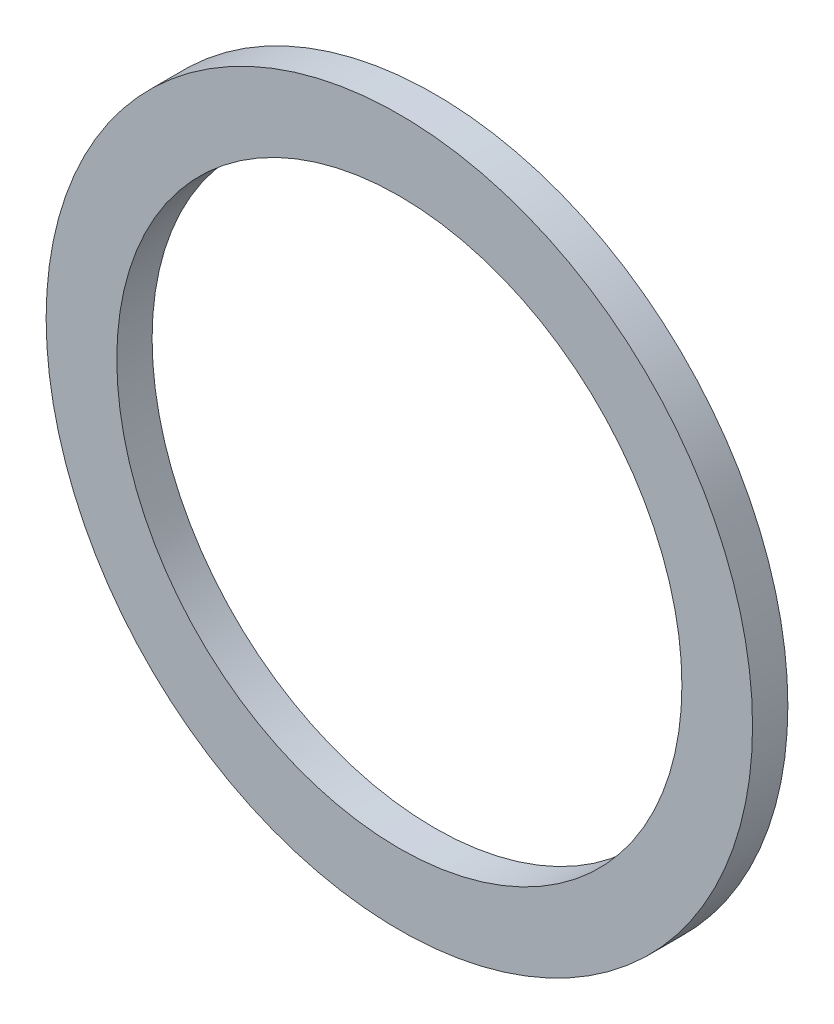
ISO-10303-21;
HEADER;
FILE_DESCRIPTION(('STEP AP214'),'2;1');
FILE_NAME('part.step','',(''),(''),'','','');
FILE_SCHEMA(('AUTOMOTIVE_DESIGN { 1 0 10303 214 1 1 1 1 }'));
ENDSEC;
DATA;
#1=APPLICATION_CONTEXT('core data for automotive mechanical design processes');
#2=APPLICATION_PROTOCOL_DEFINITION('international standard','automotive_design',2000,#1);
#3=PRODUCT_CONTEXT('',#1,'mechanical');
#4=PRODUCT('Part','Part','',(#3));
#5=PRODUCT_RELATED_PRODUCT_CATEGORY('part','',(#4));
#6=PRODUCT_DEFINITION_FORMATION('','',#4);
#7=PRODUCT_DEFINITION_CONTEXT('part definition',#1,'design');
#8=PRODUCT_DEFINITION('design','',#6,#7);
#9=PRODUCT_DEFINITION_SHAPE('','',#8);
#10=(LENGTH_UNIT() NAMED_UNIT(*) SI_UNIT(.MILLI.,.METRE.));
#11=(NAMED_UNIT(*) PLANE_ANGLE_UNIT() SI_UNIT($,.RADIAN.));
#12=(NAMED_UNIT(*) SI_UNIT($,.STERADIAN.) SOLID_ANGLE_UNIT());
#13=UNCERTAINTY_MEASURE_WITH_UNIT(LENGTH_MEASURE(1.E-05),#10,'distance_accuracy_value','');
#14=(GEOMETRIC_REPRESENTATION_CONTEXT(3) GLOBAL_UNCERTAINTY_ASSIGNED_CONTEXT((#13)) GLOBAL_UNIT_ASSIGNED_CONTEXT((#10,
#11,#12)) REPRESENTATION_CONTEXT('',''));
#15=CARTESIAN_POINT('',(0.,0.,0.));
#16=DIRECTION('',(0.,0.,1.));
#17=DIRECTION('',(1.,0.,0.));
#18=AXIS2_PLACEMENT_3D('',#15,#16,#17);
#19=CARTESIAN_POINT('',(-8.00000011920929,-9.00000002980232,2.));
#20=DIRECTION('',(0.,0.,1.));
#21=DIRECTION('',(1.,0.,0.));
#22=AXIS2_PLACEMENT_3D('',#19,#20,#21);
#23=PLANE('',#22);
#24=CARTESIAN_POINT('',(-8.00000011920929,-9.00000002980232,2.));
#25=DIRECTION('',(0.,0.,-1.));
#26=DIRECTION('',(-1.,0.,0.));
#27=AXIS2_PLACEMENT_3D('',#24,#25,#26);
#28=CIRCLE('',#27,0.800000014901161);
#29=CARTESIAN_POINT('',(-7.20000010430813,-9.00000002980232,2.));
#30=VERTEX_POINT('',#29);
#31=EDGE_CURVE('E47',#30,#30,#28,.T.);
#32=ORIENTED_EDGE('',*,*,#31,.F.);
#33=EDGE_LOOP('',(#32));
#34=FACE_BOUND('',#33,.T.);
#35=CARTESIAN_POINT('',(-8.00000011920929,-9.00000002980232,2.));
#36=DIRECTION('',(0.,0.,1.));
#37=DIRECTION('',(-1.,0.,0.));
#38=AXIS2_PLACEMENT_3D('',#35,#36,#37);
#39=CIRCLE('',#38,1.00000001490116);
#40=CARTESIAN_POINT('',(-7.00000010430813,-9.00000002980232,2.));
#41=VERTEX_POINT('',#40);
#42=EDGE_CURVE('E11',#41,#41,#39,.T.);
#43=ORIENTED_EDGE('',*,*,#42,.F.);
#44=EDGE_LOOP('',(#43));
#45=FACE_BOUND('',#44,.T.);
#46=ADVANCED_FACE('F17',(#34,#45),#23,.F.);
#47=CARTESIAN_POINT('',(-8.00000011920929,-9.00000002980232,2.1));
#48=DIRECTION('',(0.,0.,1.));
#49=DIRECTION('',(1.,0.,0.));
#50=AXIS2_PLACEMENT_3D('',#47,#48,#49);
#51=PLANE('',#50);
#52=CARTESIAN_POINT('',(-8.00000011920929,-9.00000002980232,2.1));
#53=DIRECTION('',(0.,0.,-1.));
#54=DIRECTION('',(-1.,0.,0.));
#55=AXIS2_PLACEMENT_3D('',#52,#53,#54);
#56=CIRCLE('',#55,0.800000014901161);
#57=CARTESIAN_POINT('',(-7.20000010430813,-9.00000002980232,2.1));
#58=VERTEX_POINT('',#57);
#59=EDGE_CURVE('E54',#58,#58,#56,.T.);
#60=ORIENTED_EDGE('',*,*,#59,.T.);
#61=EDGE_LOOP('',(#60));
#62=FACE_BOUND('',#61,.T.);
#63=CARTESIAN_POINT('',(-8.00000011920929,-9.00000002980232,2.1));
#64=DIRECTION('',(0.,0.,1.));
#65=DIRECTION('',(-1.,0.,0.));
#66=AXIS2_PLACEMENT_3D('',#63,#64,#65);
#67=CIRCLE('',#66,1.00000001490116);
#68=CARTESIAN_POINT('',(-7.00000010430813,-9.00000002980232,2.1));
#69=VERTEX_POINT('',#68);
#70=EDGE_CURVE('E67',#69,#69,#67,.T.);
#71=ORIENTED_EDGE('',*,*,#70,.T.);
#72=EDGE_LOOP('',(#71));
#73=FACE_BOUND('',#72,.T.);
#74=ADVANCED_FACE('F58',(#62,#73),#51,.T.);
#75=CARTESIAN_POINT('',(-8.00000011920929,-9.00000002980232,2.));
#76=DIRECTION('',(0.,0.,1.));
#77=DIRECTION('',(-1.,0.,0.));
#78=AXIS2_PLACEMENT_3D('',#75,#76,#77);
#79=CYLINDRICAL_SURFACE('',#78,1.00000001490116);
#80=ORIENTED_EDGE('',*,*,#70,.F.);
#81=DIRECTION('',(0.,0.,-1.));
#82=VECTOR('',#81,1.);
#83=CARTESIAN_POINT('',(-7.00000010430813,-9.00000002980232,2.));
#84=LINE('',#83,#82);
#85=EDGE_CURVE('E20',#69,#41,#84,.T.);
#86=ORIENTED_EDGE('',*,*,#85,.T.);
#87=ORIENTED_EDGE('',*,*,#42,.T.);
#88=ORIENTED_EDGE('',*,*,#85,.F.);
#89=EDGE_LOOP('',(#80,#86,#87,#88));
#90=FACE_BOUND('',#89,.T.);
#91=ADVANCED_FACE('F75',(#90),#79,.T.);
#92=CARTESIAN_POINT('',(-8.00000011920929,-9.00000002980232,2.));
#93=DIRECTION('',(0.,0.,1.));
#94=DIRECTION('',(-1.,0.,0.));
#95=AXIS2_PLACEMENT_3D('',#92,#93,#94);
#96=CYLINDRICAL_SURFACE('',#95,0.800000014901161);
#97=ORIENTED_EDGE('',*,*,#59,.F.);
#98=DIRECTION('',(0.,0.,-1.));
#99=VECTOR('',#98,1.);
#100=CARTESIAN_POINT('',(-7.20000010430813,-9.00000002980232,2.));
#101=LINE('',#100,#99);
#102=EDGE_CURVE('E51',#58,#30,#101,.T.);
#103=ORIENTED_EDGE('',*,*,#102,.T.);
#104=ORIENTED_EDGE('',*,*,#31,.T.);
#105=ORIENTED_EDGE('',*,*,#102,.F.);
#106=EDGE_LOOP('',(#97,#103,#104,#105));
#107=FACE_BOUND('',#106,.T.);
#108=ADVANCED_FACE('F53',(#107),#96,.F.);
#109=CLOSED_SHELL('',(#46,#74,#91,#108));
#110=MANIFOLD_SOLID_BREP('B1',#109);
#111=ADVANCED_BREP_SHAPE_REPRESENTATION('',(#18,#110),#14);
#112=SHAPE_DEFINITION_REPRESENTATION(#9,#111);
ENDSEC;
END-ISO-10303-21;
